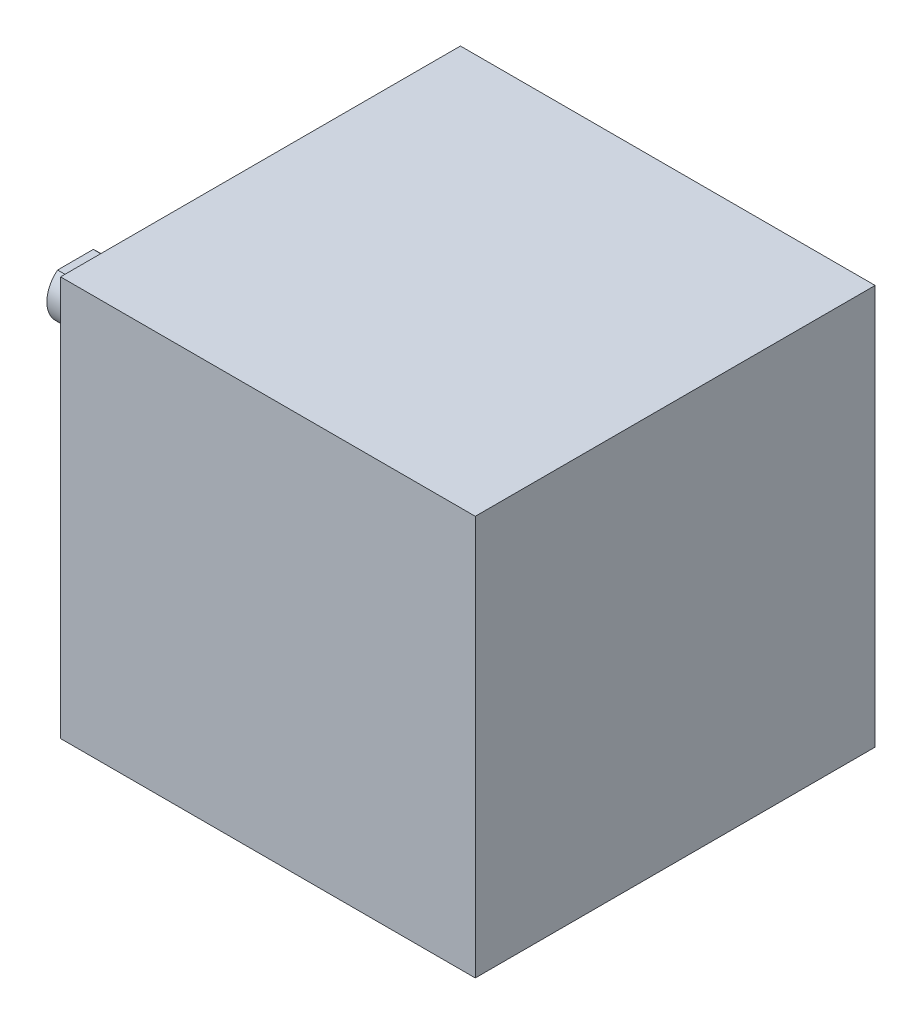
ISO-10303-21;
HEADER;
FILE_DESCRIPTION(('STEP AP214'),'2;1');
FILE_NAME('part.step','',(''),(''),'','','');
FILE_SCHEMA(('AUTOMOTIVE_DESIGN { 1 0 10303 214 1 1 1 1 }'));
ENDSEC;
DATA;
#1=APPLICATION_CONTEXT('core data for automotive mechanical design processes');
#2=APPLICATION_PROTOCOL_DEFINITION('international standard','automotive_design',2000,#1);
#3=PRODUCT_CONTEXT('',#1,'mechanical');
#4=PRODUCT('Part','Part','',(#3));
#5=PRODUCT_RELATED_PRODUCT_CATEGORY('part','',(#4));
#6=PRODUCT_DEFINITION_FORMATION('','',#4);
#7=PRODUCT_DEFINITION_CONTEXT('part definition',#1,'design');
#8=PRODUCT_DEFINITION('design','',#6,#7);
#9=PRODUCT_DEFINITION_SHAPE('','',#8);
#10=(LENGTH_UNIT() NAMED_UNIT(*) SI_UNIT(.MILLI.,.METRE.));
#11=(NAMED_UNIT(*) PLANE_ANGLE_UNIT() SI_UNIT($,.RADIAN.));
#12=(NAMED_UNIT(*) SI_UNIT($,.STERADIAN.) SOLID_ANGLE_UNIT());
#13=UNCERTAINTY_MEASURE_WITH_UNIT(LENGTH_MEASURE(1.E-05),#10,'distance_accuracy_value','');
#14=(GEOMETRIC_REPRESENTATION_CONTEXT(3) GLOBAL_UNCERTAINTY_ASSIGNED_CONTEXT((#13)) GLOBAL_UNIT_ASSIGNED_CONTEXT((#10,
#11,#12)) REPRESENTATION_CONTEXT('',''));
#15=CARTESIAN_POINT('',(0.,0.,0.));
#16=DIRECTION('',(0.,0.,1.));
#17=DIRECTION('',(1.,0.,0.));
#18=AXIS2_PLACEMENT_3D('',#15,#16,#17);
#19=CARTESIAN_POINT('',(-2.,-17.5,17.5));
#20=DIRECTION('',(-1.,0.,0.));
#21=DIRECTION('',(0.,0.,1.));
#22=AXIS2_PLACEMENT_3D('',#19,#20,#21);
#23=PLANE('',#22);
#24=CARTESIAN_POINT('',(-2.,-17.5,17.5));
#25=DIRECTION('',(-1.,0.,0.));
#26=DIRECTION('',(0.,0.,1.));
#27=AXIS2_PLACEMENT_3D('',#24,#25,#26);
#28=CIRCLE('',#27,11.);
#29=CARTESIAN_POINT('',(-2.,-17.5,28.5));
#30=VERTEX_POINT('',#29);
#31=EDGE_CURVE('E109',#30,#30,#28,.T.);
#32=ORIENTED_EDGE('',*,*,#31,.T.);
#33=EDGE_LOOP('',(#32));
#34=FACE_BOUND('',#33,.T.);
#35=DIRECTION('',(0.,0.,-1.));
#36=VECTOR('',#35,1.);
#37=CARTESIAN_POINT('',(-2.,-15.55,17.5));
#38=LINE('',#37,#36);
#39=CARTESIAN_POINT('',(-2.,-15.55,19.0644487847162));
#40=VERTEX_POINT('',#39);
#41=CARTESIAN_POINT('',(-2.,-15.55,15.9355512152838));
#42=VERTEX_POINT('',#41);
#43=EDGE_CURVE('E102',#40,#42,#38,.T.);
#44=ORIENTED_EDGE('',*,*,#43,.F.);
#45=CARTESIAN_POINT('',(-2.,-17.5,17.5));
#46=DIRECTION('',(-1.,0.,0.));
#47=DIRECTION('',(0.,0.,1.));
#48=AXIS2_PLACEMENT_3D('',#45,#46,#47);
#49=CIRCLE('',#48,2.5);
#50=EDGE_CURVE('E245',#42,#40,#49,.T.);
#51=ORIENTED_EDGE('',*,*,#50,.F.);
#52=EDGE_LOOP('',(#44,#51));
#53=FACE_BOUND('',#52,.T.);
#54=ADVANCED_FACE('F30',(#34,#53),#23,.T.);
#55=CARTESIAN_POINT('',(0.,-35.,0.));
#56=DIRECTION('',(-1.,0.,0.));
#57=DIRECTION('',(0.,0.,1.));
#58=AXIS2_PLACEMENT_3D('',#55,#56,#57);
#59=PLANE('',#58);
#60=DIRECTION('',(0.,1.,0.));
#61=VECTOR('',#60,1.);
#62=CARTESIAN_POINT('',(0.,0.,0.));
#63=LINE('',#62,#61);
#64=CARTESIAN_POINT('',(0.,-35.,0.));
#65=VERTEX_POINT('',#64);
#66=CARTESIAN_POINT('',(0.,0.,0.));
#67=VERTEX_POINT('',#66);
#68=EDGE_CURVE('E115',#65,#67,#63,.T.);
#69=ORIENTED_EDGE('',*,*,#68,.F.);
#70=DIRECTION('',(0.,0.,-1.));
#71=VECTOR('',#70,1.);
#72=CARTESIAN_POINT('',(0.,-35.,0.));
#73=LINE('',#72,#71);
#74=CARTESIAN_POINT('',(0.,-35.,35.));
#75=VERTEX_POINT('',#74);
#76=EDGE_CURVE('E75',#75,#65,#73,.T.);
#77=ORIENTED_EDGE('',*,*,#76,.F.);
#78=DIRECTION('',(0.,-1.,0.));
#79=VECTOR('',#78,1.);
#80=CARTESIAN_POINT('',(0.,0.,35.));
#81=LINE('',#80,#79);
#82=CARTESIAN_POINT('',(0.,0.,35.));
#83=VERTEX_POINT('',#82);
#84=EDGE_CURVE('E128',#83,#75,#81,.T.);
#85=ORIENTED_EDGE('',*,*,#84,.F.);
#86=DIRECTION('',(0.,0.,1.));
#87=VECTOR('',#86,1.);
#88=CARTESIAN_POINT('',(0.,0.,0.));
#89=LINE('',#88,#87);
#90=EDGE_CURVE('E126',#67,#83,#89,.T.);
#91=ORIENTED_EDGE('',*,*,#90,.F.);
#92=EDGE_LOOP('',(#69,#77,#85,#91));
#93=FACE_BOUND('',#92,.T.);
#94=CARTESIAN_POINT('',(0.,-17.5,17.5));
#95=DIRECTION('',(-1.,0.,0.));
#96=DIRECTION('',(0.,0.,1.));
#97=AXIS2_PLACEMENT_3D('',#94,#95,#96);
#98=CIRCLE('',#97,11.);
#99=CARTESIAN_POINT('',(0.,-17.5,28.5));
#100=VERTEX_POINT('',#99);
#101=EDGE_CURVE('E106',#100,#100,#98,.T.);
#102=ORIENTED_EDGE('',*,*,#101,.F.);
#103=EDGE_LOOP('',(#102));
#104=FACE_BOUND('',#103,.T.);
#105=ADVANCED_FACE('F141',(#93,#104),#59,.T.);
#106=CARTESIAN_POINT('',(36.3,0.,0.));
#107=DIRECTION('',(0.,0.,1.));
#108=DIRECTION('',(0.,-1.,0.));
#109=AXIS2_PLACEMENT_3D('',#106,#107,#108);
#110=PLANE('',#109);
#111=ORIENTED_EDGE('',*,*,#68,.T.);
#112=DIRECTION('',(-1.,0.,0.));
#113=VECTOR('',#112,1.);
#114=CARTESIAN_POINT('',(36.3,0.,0.));
#115=LINE('',#114,#113);
#116=CARTESIAN_POINT('',(36.3,0.,0.));
#117=VERTEX_POINT('',#116);
#118=EDGE_CURVE('E11',#117,#67,#115,.T.);
#119=ORIENTED_EDGE('',*,*,#118,.F.);
#120=DIRECTION('',(0.,1.,0.));
#121=VECTOR('',#120,1.);
#122=CARTESIAN_POINT('',(36.3,0.,0.));
#123=LINE('',#122,#121);
#124=CARTESIAN_POINT('',(36.3,-35.,0.));
#125=VERTEX_POINT('',#124);
#126=EDGE_CURVE('E117',#125,#117,#123,.T.);
#127=ORIENTED_EDGE('',*,*,#126,.F.);
#128=DIRECTION('',(-1.,0.,0.));
#129=VECTOR('',#128,1.);
#130=CARTESIAN_POINT('',(36.3,-35.,0.));
#131=LINE('',#130,#129);
#132=EDGE_CURVE('E123',#125,#65,#131,.T.);
#133=ORIENTED_EDGE('',*,*,#132,.T.);
#134=EDGE_LOOP('',(#111,#119,#127,#133));
#135=FACE_BOUND('',#134,.T.);
#136=ADVANCED_FACE('F32',(#135),#110,.F.);
#137=CARTESIAN_POINT('',(36.3,0.,0.));
#138=DIRECTION('',(0.,-1.,0.));
#139=DIRECTION('',(0.,0.,-1.));
#140=AXIS2_PLACEMENT_3D('',#137,#138,#139);
#141=PLANE('',#140);
#142=ORIENTED_EDGE('',*,*,#90,.T.);
#143=DIRECTION('',(-1.,0.,0.));
#144=VECTOR('',#143,1.);
#145=CARTESIAN_POINT('',(36.3,0.,35.));
#146=LINE('',#145,#144);
#147=CARTESIAN_POINT('',(36.3,0.,35.));
#148=VERTEX_POINT('',#147);
#149=EDGE_CURVE('E38',#148,#83,#146,.T.);
#150=ORIENTED_EDGE('',*,*,#149,.F.);
#151=DIRECTION('',(0.,0.,1.));
#152=VECTOR('',#151,1.);
#153=CARTESIAN_POINT('',(36.3,0.,0.));
#154=LINE('',#153,#152);
#155=EDGE_CURVE('E82',#117,#148,#154,.T.);
#156=ORIENTED_EDGE('',*,*,#155,.F.);
#157=ORIENTED_EDGE('',*,*,#118,.T.);
#158=EDGE_LOOP('',(#142,#150,#156,#157));
#159=FACE_BOUND('',#158,.T.);
#160=ADVANCED_FACE('F156',(#159),#141,.F.);
#161=CARTESIAN_POINT('',(36.3,0.,35.));
#162=DIRECTION('',(0.,0.,-1.));
#163=DIRECTION('',(-1.,0.,0.));
#164=AXIS2_PLACEMENT_3D('',#161,#162,#163);
#165=PLANE('',#164);
#166=ORIENTED_EDGE('',*,*,#84,.T.);
#167=DIRECTION('',(-1.,0.,0.));
#168=VECTOR('',#167,1.);
#169=CARTESIAN_POINT('',(36.3,-35.,35.));
#170=LINE('',#169,#168);
#171=CARTESIAN_POINT('',(36.3,-35.,35.));
#172=VERTEX_POINT('',#171);
#173=EDGE_CURVE('E132',#172,#75,#170,.T.);
#174=ORIENTED_EDGE('',*,*,#173,.F.);
#175=DIRECTION('',(0.,-1.,0.));
#176=VECTOR('',#175,1.);
#177=CARTESIAN_POINT('',(36.3,0.,35.));
#178=LINE('',#177,#176);
#179=EDGE_CURVE('E120',#148,#172,#178,.T.);
#180=ORIENTED_EDGE('',*,*,#179,.F.);
#181=ORIENTED_EDGE('',*,*,#149,.T.);
#182=EDGE_LOOP('',(#166,#174,#180,#181));
#183=FACE_BOUND('',#182,.T.);
#184=ADVANCED_FACE('F137',(#183),#165,.F.);
#185=CARTESIAN_POINT('',(36.3,-35.,0.));
#186=DIRECTION('',(0.,1.,0.));
#187=DIRECTION('',(0.,0.,1.));
#188=AXIS2_PLACEMENT_3D('',#185,#186,#187);
#189=PLANE('',#188);
#190=ORIENTED_EDGE('',*,*,#76,.T.);
#191=ORIENTED_EDGE('',*,*,#132,.F.);
#192=DIRECTION('',(0.,0.,-1.));
#193=VECTOR('',#192,1.);
#194=CARTESIAN_POINT('',(36.3,-35.,0.));
#195=LINE('',#194,#193);
#196=EDGE_CURVE('E54',#172,#125,#195,.T.);
#197=ORIENTED_EDGE('',*,*,#196,.F.);
#198=ORIENTED_EDGE('',*,*,#173,.T.);
#199=EDGE_LOOP('',(#190,#191,#197,#198));
#200=FACE_BOUND('',#199,.T.);
#201=ADVANCED_FACE('F146',(#200),#189,.F.);
#202=CARTESIAN_POINT('',(36.3,-35.,0.));
#203=DIRECTION('',(-1.,0.,0.));
#204=DIRECTION('',(0.,0.,1.));
#205=AXIS2_PLACEMENT_3D('',#202,#203,#204);
#206=PLANE('',#205);
#207=ORIENTED_EDGE('',*,*,#126,.T.);
#208=ORIENTED_EDGE('',*,*,#155,.T.);
#209=ORIENTED_EDGE('',*,*,#179,.T.);
#210=ORIENTED_EDGE('',*,*,#196,.T.);
#211=EDGE_LOOP('',(#207,#208,#209,#210));
#212=FACE_BOUND('',#211,.T.);
#213=ADVANCED_FACE('F148',(#212),#206,.F.);
#214=CARTESIAN_POINT('',(-2.,-17.5,17.5));
#215=DIRECTION('',(1.,0.,0.));
#216=DIRECTION('',(0.,0.,-1.));
#217=AXIS2_PLACEMENT_3D('',#214,#215,#216);
#218=CYLINDRICAL_SURFACE('',#217,11.);
#219=ORIENTED_EDGE('',*,*,#31,.F.);
#220=EDGE_LOOP('',(#219));
#221=FACE_BOUND('',#220,.T.);
#222=ORIENTED_EDGE('',*,*,#101,.T.);
#223=EDGE_LOOP('',(#222));
#224=FACE_BOUND('',#223,.T.);
#225=ADVANCED_FACE('F154',(#221,#224),#218,.T.);
#226=CARTESIAN_POINT('',(-16.2,-17.5,17.5));
#227=DIRECTION('',(1.,0.,0.));
#228=DIRECTION('',(0.,0.,-1.));
#229=AXIS2_PLACEMENT_3D('',#226,#227,#228);
#230=CYLINDRICAL_SURFACE('',#229,2.5);
#231=ORIENTED_EDGE('',*,*,#50,.T.);
#232=DIRECTION('',(1.,0.,0.));
#233=VECTOR('',#232,1.);
#234=CARTESIAN_POINT('',(-16.2,-15.55,19.0644487847162));
#235=LINE('',#234,#233);
#236=CARTESIAN_POINT('',(-16.2,-15.55,19.0644487847162));
#237=VERTEX_POINT('',#236);
#238=EDGE_CURVE('E45',#237,#40,#235,.T.);
#239=ORIENTED_EDGE('',*,*,#238,.F.);
#240=CARTESIAN_POINT('',(-16.2,-17.5,17.5));
#241=DIRECTION('',(-1.,0.,0.));
#242=DIRECTION('',(0.,0.,1.));
#243=AXIS2_PLACEMENT_3D('',#240,#241,#242);
#244=CIRCLE('',#243,2.5);
#245=CARTESIAN_POINT('',(-16.2,-15.55,15.9355512152838));
#246=VERTEX_POINT('',#245);
#247=EDGE_CURVE('E92',#246,#237,#244,.T.);
#248=ORIENTED_EDGE('',*,*,#247,.F.);
#249=DIRECTION('',(1.,0.,0.));
#250=VECTOR('',#249,1.);
#251=CARTESIAN_POINT('',(-16.2,-15.55,15.9355512152838));
#252=LINE('',#251,#250);
#253=EDGE_CURVE('E96',#246,#42,#252,.T.);
#254=ORIENTED_EDGE('',*,*,#253,.T.);
#255=EDGE_LOOP('',(#231,#239,#248,#254));
#256=FACE_BOUND('',#255,.T.);
#257=ADVANCED_FACE('F94',(#256),#230,.T.);
#258=CARTESIAN_POINT('',(-16.2,-15.55,17.5));
#259=DIRECTION('',(0.,-1.,0.));
#260=DIRECTION('',(0.,0.,-1.));
#261=AXIS2_PLACEMENT_3D('',#258,#259,#260);
#262=PLANE('',#261);
#263=ORIENTED_EDGE('',*,*,#43,.T.);
#264=ORIENTED_EDGE('',*,*,#253,.F.);
#265=DIRECTION('',(0.,0.,-1.));
#266=VECTOR('',#265,1.);
#267=CARTESIAN_POINT('',(-16.2,-15.55,17.5));
#268=LINE('',#267,#266);
#269=EDGE_CURVE('E99',#237,#246,#268,.T.);
#270=ORIENTED_EDGE('',*,*,#269,.F.);
#271=ORIENTED_EDGE('',*,*,#238,.T.);
#272=EDGE_LOOP('',(#263,#264,#270,#271));
#273=FACE_BOUND('',#272,.T.);
#274=ADVANCED_FACE('F104',(#273),#262,.F.);
#275=CARTESIAN_POINT('',(-16.2,-17.5,17.5));
#276=DIRECTION('',(-1.,0.,0.));
#277=DIRECTION('',(0.,0.,1.));
#278=AXIS2_PLACEMENT_3D('',#275,#276,#277);
#279=PLANE('',#278);
#280=ORIENTED_EDGE('',*,*,#269,.T.);
#281=ORIENTED_EDGE('',*,*,#247,.T.);
#282=EDGE_LOOP('',(#280,#281));
#283=FACE_BOUND('',#282,.T.);
#284=ADVANCED_FACE('F101',(#283),#279,.T.);
#285=CLOSED_SHELL('',(#54,#105,#136,#160,#184,#201,#213,#225,#257,#274,#284));
#286=MANIFOLD_SOLID_BREP('B2',#285);
#287=ADVANCED_BREP_SHAPE_REPRESENTATION('',(#18,#286),#14);
#288=SHAPE_DEFINITION_REPRESENTATION(#9,#287);
ENDSEC;
END-ISO-10303-21;
